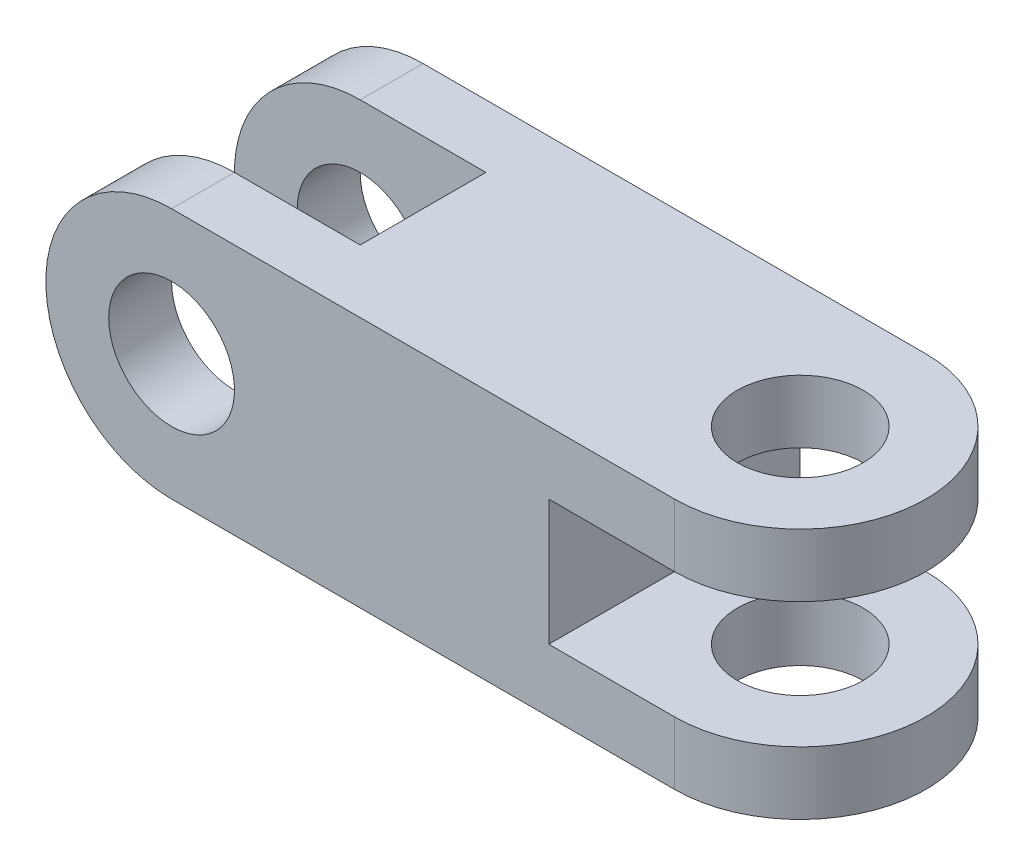
ISO-10303-21;
HEADER;
FILE_DESCRIPTION(('STEP AP214'),'2;1');
FILE_NAME('part.step','',(''),(''),'','','');
FILE_SCHEMA(('AUTOMOTIVE_DESIGN { 1 0 10303 214 1 1 1 1 }'));
ENDSEC;
DATA;
#1=APPLICATION_CONTEXT('core data for automotive mechanical design processes');
#2=APPLICATION_PROTOCOL_DEFINITION('international standard','automotive_design',2000,#1);
#3=PRODUCT_CONTEXT('',#1,'mechanical');
#4=PRODUCT('Part','Part','',(#3));
#5=PRODUCT_RELATED_PRODUCT_CATEGORY('part','',(#4));
#6=PRODUCT_DEFINITION_FORMATION('','',#4);
#7=PRODUCT_DEFINITION_CONTEXT('part definition',#1,'design');
#8=PRODUCT_DEFINITION('design','',#6,#7);
#9=PRODUCT_DEFINITION_SHAPE('','',#8);
#10=(LENGTH_UNIT() NAMED_UNIT(*) SI_UNIT(.MILLI.,.METRE.));
#11=(NAMED_UNIT(*) PLANE_ANGLE_UNIT() SI_UNIT($,.RADIAN.));
#12=(NAMED_UNIT(*) SI_UNIT($,.STERADIAN.) SOLID_ANGLE_UNIT());
#13=UNCERTAINTY_MEASURE_WITH_UNIT(LENGTH_MEASURE(1.E-05),#10,'distance_accuracy_value','');
#14=(GEOMETRIC_REPRESENTATION_CONTEXT(3) GLOBAL_UNCERTAINTY_ASSIGNED_CONTEXT((#13)) GLOBAL_UNIT_ASSIGNED_CONTEXT((#10,
#11,#12)) REPRESENTATION_CONTEXT('',''));
#15=CARTESIAN_POINT('',(0.,0.,0.));
#16=DIRECTION('',(0.,0.,1.));
#17=DIRECTION('',(1.,0.,0.));
#18=AXIS2_PLACEMENT_3D('',#15,#16,#17);
#19=CARTESIAN_POINT('',(50.,5.00000000000001,20.));
#20=DIRECTION('',(0.,-1.,0.));
#21=DIRECTION('',(1.,0.,0.));
#22=AXIS2_PLACEMENT_3D('',#19,#20,#21);
#23=PLANE('',#22);
#24=CARTESIAN_POINT('',(40.,5.00000000000001,10.));
#25=DIRECTION('',(0.,-1.,0.));
#26=DIRECTION('',(1.,0.,0.));
#27=AXIS2_PLACEMENT_3D('',#24,#25,#26);
#28=CIRCLE('',#27,5.00000000000001);
#29=CARTESIAN_POINT('',(45.,5.00000000000001,10.));
#30=VERTEX_POINT('',#29);
#31=EDGE_CURVE('E183',#30,#30,#28,.T.);
#32=ORIENTED_EDGE('',*,*,#31,.T.);
#33=EDGE_LOOP('',(#32));
#34=FACE_BOUND('',#33,.T.);
#35=CARTESIAN_POINT('',(40.,5.00000000000001,10.));
#36=DIRECTION('',(0.,-1.,0.));
#37=DIRECTION('',(1.,0.,0.));
#38=AXIS2_PLACEMENT_3D('',#35,#36,#37);
#39=CIRCLE('',#38,10.);
#40=CARTESIAN_POINT('',(40.,5.00000000000001,0.));
#41=VERTEX_POINT('',#40);
#42=CARTESIAN_POINT('',(40.,5.00000000000001,20.));
#43=VERTEX_POINT('',#42);
#44=EDGE_CURVE('E283',#41,#43,#39,.T.);
#45=ORIENTED_EDGE('',*,*,#44,.F.);
#46=DIRECTION('',(-1.,0.,0.));
#47=VECTOR('',#46,1.);
#48=CARTESIAN_POINT('',(50.,5.00000000000001,0.));
#49=LINE('',#48,#47);
#50=CARTESIAN_POINT('',(30.,5.00000000000001,0.));
#51=VERTEX_POINT('',#50);
#52=EDGE_CURVE('E282',#41,#51,#49,.T.);
#53=ORIENTED_EDGE('',*,*,#52,.T.);
#54=DIRECTION('',(0.,0.,-1.));
#55=VECTOR('',#54,1.);
#56=CARTESIAN_POINT('',(30.,5.00000000000001,20.));
#57=LINE('',#56,#55);
#58=CARTESIAN_POINT('',(30.,5.00000000000001,20.));
#59=VERTEX_POINT('',#58);
#60=EDGE_CURVE('E274',#59,#51,#57,.T.);
#61=ORIENTED_EDGE('',*,*,#60,.F.);
#62=DIRECTION('',(-1.,0.,0.));
#63=VECTOR('',#62,1.);
#64=CARTESIAN_POINT('',(50.,5.00000000000001,20.));
#65=LINE('',#64,#63);
#66=EDGE_CURVE('E287',#43,#59,#65,.T.);
#67=ORIENTED_EDGE('',*,*,#66,.F.);
#68=EDGE_LOOP('',(#45,#53,#61,#67));
#69=FACE_BOUND('',#68,.T.);
#70=ADVANCED_FACE('F38',(#34,#69),#23,.F.);
#71=CARTESIAN_POINT('',(50.,15.,20.));
#72=DIRECTION('',(0.,1.,0.));
#73=DIRECTION('',(-1.,0.,0.));
#74=AXIS2_PLACEMENT_3D('',#71,#72,#73);
#75=PLANE('',#74);
#76=CARTESIAN_POINT('',(40.,15.,10.));
#77=DIRECTION('',(0.,1.,0.));
#78=DIRECTION('',(-1.,0.,0.));
#79=AXIS2_PLACEMENT_3D('',#76,#77,#78);
#80=CIRCLE('',#79,5.00000000000001);
#81=CARTESIAN_POINT('',(35.,15.,10.));
#82=VERTEX_POINT('',#81);
#83=EDGE_CURVE('E180',#82,#82,#80,.T.);
#84=ORIENTED_EDGE('',*,*,#83,.T.);
#85=EDGE_LOOP('',(#84));
#86=FACE_BOUND('',#85,.T.);
#87=CARTESIAN_POINT('',(40.,15.,10.));
#88=DIRECTION('',(0.,1.,0.));
#89=DIRECTION('',(-1.,0.,0.));
#90=AXIS2_PLACEMENT_3D('',#87,#88,#89);
#91=CIRCLE('',#90,10.);
#92=CARTESIAN_POINT('',(40.,15.,20.));
#93=VERTEX_POINT('',#92);
#94=CARTESIAN_POINT('',(40.,15.,0.));
#95=VERTEX_POINT('',#94);
#96=EDGE_CURVE('E53',#93,#95,#91,.T.);
#97=ORIENTED_EDGE('',*,*,#96,.F.);
#98=DIRECTION('',(1.,0.,0.));
#99=VECTOR('',#98,1.);
#100=CARTESIAN_POINT('',(50.,15.,20.));
#101=LINE('',#100,#99);
#102=CARTESIAN_POINT('',(30.,15.,20.));
#103=VERTEX_POINT('',#102);
#104=EDGE_CURVE('E292',#103,#93,#101,.T.);
#105=ORIENTED_EDGE('',*,*,#104,.F.);
#106=DIRECTION('',(0.,0.,-1.));
#107=VECTOR('',#106,1.);
#108=CARTESIAN_POINT('',(30.,15.,20.));
#109=LINE('',#108,#107);
#110=CARTESIAN_POINT('',(30.,15.,0.));
#111=VERTEX_POINT('',#110);
#112=EDGE_CURVE('E302',#103,#111,#109,.T.);
#113=ORIENTED_EDGE('',*,*,#112,.T.);
#114=DIRECTION('',(1.,0.,0.));
#115=VECTOR('',#114,1.);
#116=CARTESIAN_POINT('',(50.,15.,0.));
#117=LINE('',#116,#115);
#118=EDGE_CURVE('E290',#111,#95,#117,.T.);
#119=ORIENTED_EDGE('',*,*,#118,.T.);
#120=EDGE_LOOP('',(#97,#105,#113,#119));
#121=FACE_BOUND('',#120,.T.);
#122=ADVANCED_FACE('F208',(#86,#121),#75,.F.);
#123=CARTESIAN_POINT('',(30.,15.,20.));
#124=DIRECTION('',(-1.,0.,0.));
#125=DIRECTION('',(0.,-1.,0.));
#126=AXIS2_PLACEMENT_3D('',#123,#124,#125);
#127=PLANE('',#126);
#128=DIRECTION('',(0.,1.,0.));
#129=VECTOR('',#128,1.);
#130=CARTESIAN_POINT('',(30.,15.,0.));
#131=LINE('',#130,#129);
#132=EDGE_CURVE('E294',#51,#111,#131,.T.);
#133=ORIENTED_EDGE('',*,*,#132,.T.);
#134=ORIENTED_EDGE('',*,*,#112,.F.);
#135=DIRECTION('',(0.,1.,0.));
#136=VECTOR('',#135,1.);
#137=CARTESIAN_POINT('',(30.,15.,20.));
#138=LINE('',#137,#136);
#139=EDGE_CURVE('E289',#59,#103,#138,.T.);
#140=ORIENTED_EDGE('',*,*,#139,.F.);
#141=ORIENTED_EDGE('',*,*,#60,.T.);
#142=EDGE_LOOP('',(#133,#134,#140,#141));
#143=FACE_BOUND('',#142,.T.);
#144=ADVANCED_FACE('F214',(#143),#127,.F.);
#145=CARTESIAN_POINT('',(40.,20.,10.));
#146=DIRECTION('',(0.,-1.,0.));
#147=DIRECTION('',(0.,0.,-1.));
#148=AXIS2_PLACEMENT_3D('',#145,#146,#147);
#149=PLANE('',#148);
#150=CARTESIAN_POINT('',(40.,20.,10.));
#151=DIRECTION('',(0.,1.,0.));
#152=DIRECTION('',(0.,0.,1.));
#153=AXIS2_PLACEMENT_3D('',#150,#151,#152);
#154=CIRCLE('',#153,5.00000000000001);
#155=CARTESIAN_POINT('',(40.,20.,15.));
#156=VERTEX_POINT('',#155);
#157=EDGE_CURVE('E237',#156,#156,#154,.T.);
#158=ORIENTED_EDGE('',*,*,#157,.F.);
#159=EDGE_LOOP('',(#158));
#160=FACE_BOUND('',#159,.T.);
#161=DIRECTION('',(-1.,0.,0.));
#162=VECTOR('',#161,1.);
#163=CARTESIAN_POINT('',(40.,20.,0.));
#164=LINE('',#163,#162);
#165=CARTESIAN_POINT('',(40.,20.,0.));
#166=VERTEX_POINT('',#165);
#167=CARTESIAN_POINT('',(0.,20.,0.));
#168=VERTEX_POINT('',#167);
#169=EDGE_CURVE('E161',#166,#168,#164,.T.);
#170=ORIENTED_EDGE('',*,*,#169,.T.);
#171=DIRECTION('',(0.,0.,-1.));
#172=VECTOR('',#171,1.);
#173=CARTESIAN_POINT('',(0.,20.,20.));
#174=LINE('',#173,#172);
#175=CARTESIAN_POINT('',(0.,20.,5.));
#176=VERTEX_POINT('',#175);
#177=EDGE_CURVE('E271',#176,#168,#174,.T.);
#178=ORIENTED_EDGE('',*,*,#177,.F.);
#179=DIRECTION('',(1.,0.,0.));
#180=VECTOR('',#179,1.);
#181=CARTESIAN_POINT('',(-10.,20.,5.));
#182=LINE('',#181,#180);
#183=CARTESIAN_POINT('',(10.,20.,5.));
#184=VERTEX_POINT('',#183);
#185=EDGE_CURVE('E245',#176,#184,#182,.T.);
#186=ORIENTED_EDGE('',*,*,#185,.T.);
#187=DIRECTION('',(0.,0.,1.));
#188=VECTOR('',#187,1.);
#189=CARTESIAN_POINT('',(10.,20.,15.));
#190=LINE('',#189,#188);
#191=CARTESIAN_POINT('',(10.,20.,15.));
#192=VERTEX_POINT('',#191);
#193=EDGE_CURVE('E247',#184,#192,#190,.T.);
#194=ORIENTED_EDGE('',*,*,#193,.T.);
#195=DIRECTION('',(-1.,0.,0.));
#196=VECTOR('',#195,1.);
#197=CARTESIAN_POINT('',(-10.,20.,15.));
#198=LINE('',#197,#196);
#199=CARTESIAN_POINT('',(0.,20.,15.));
#200=VERTEX_POINT('',#199);
#201=EDGE_CURVE('E249',#192,#200,#198,.T.);
#202=ORIENTED_EDGE('',*,*,#201,.T.);
#203=CARTESIAN_POINT('',(0.,20.,20.));
#204=VERTEX_POINT('',#203);
#205=EDGE_CURVE('E267',#204,#200,#174,.T.);
#206=ORIENTED_EDGE('',*,*,#205,.F.);
#207=DIRECTION('',(1.,0.,0.));
#208=VECTOR('',#207,1.);
#209=CARTESIAN_POINT('',(40.,20.,20.));
#210=LINE('',#209,#208);
#211=CARTESIAN_POINT('',(40.,20.,20.));
#212=VERTEX_POINT('',#211);
#213=EDGE_CURVE('E62',#204,#212,#210,.T.);
#214=ORIENTED_EDGE('',*,*,#213,.T.);
#215=CARTESIAN_POINT('',(40.,20.,10.));
#216=DIRECTION('',(0.,1.,0.));
#217=DIRECTION('',(0.,0.,-1.));
#218=AXIS2_PLACEMENT_3D('',#215,#216,#217);
#219=CIRCLE('',#218,10.);
#220=EDGE_CURVE('E89',#212,#166,#219,.T.);
#221=ORIENTED_EDGE('',*,*,#220,.T.);
#222=EDGE_LOOP('',(#170,#178,#186,#194,#202,#206,#214,#221));
#223=FACE_BOUND('',#222,.T.);
#224=ADVANCED_FACE('F225',(#160,#223),#149,.F.);
#225=CARTESIAN_POINT('',(40.,0.,10.));
#226=DIRECTION('',(0.,-1.,0.));
#227=DIRECTION('',(0.,0.,-1.));
#228=AXIS2_PLACEMENT_3D('',#225,#226,#227);
#229=PLANE('',#228);
#230=CARTESIAN_POINT('',(40.,0.,10.));
#231=DIRECTION('',(0.,1.,0.));
#232=DIRECTION('',(0.,0.,1.));
#233=AXIS2_PLACEMENT_3D('',#230,#231,#232);
#234=CIRCLE('',#233,5.00000000000001);
#235=CARTESIAN_POINT('',(40.,0.,15.));
#236=VERTEX_POINT('',#235);
#237=EDGE_CURVE('E236',#236,#236,#234,.T.);
#238=ORIENTED_EDGE('',*,*,#237,.T.);
#239=EDGE_LOOP('',(#238));
#240=FACE_BOUND('',#239,.T.);
#241=DIRECTION('',(0.,0.,-1.));
#242=VECTOR('',#241,1.);
#243=CARTESIAN_POINT('',(0.,0.,20.));
#244=LINE('',#243,#242);
#245=CARTESIAN_POINT('',(0.,0.,5.));
#246=VERTEX_POINT('',#245);
#247=CARTESIAN_POINT('',(0.,0.,0.));
#248=VERTEX_POINT('',#247);
#249=EDGE_CURVE('E147',#246,#248,#244,.T.);
#250=ORIENTED_EDGE('',*,*,#249,.T.);
#251=DIRECTION('',(-1.,0.,0.));
#252=VECTOR('',#251,1.);
#253=CARTESIAN_POINT('',(40.,0.,0.));
#254=LINE('',#253,#252);
#255=CARTESIAN_POINT('',(40.,0.,0.));
#256=VERTEX_POINT('',#255);
#257=EDGE_CURVE('E254',#256,#248,#254,.T.);
#258=ORIENTED_EDGE('',*,*,#257,.F.);
#259=CARTESIAN_POINT('',(40.,0.,10.));
#260=DIRECTION('',(0.,1.,0.));
#261=DIRECTION('',(0.,0.,-1.));
#262=AXIS2_PLACEMENT_3D('',#259,#260,#261);
#263=CIRCLE('',#262,10.);
#264=CARTESIAN_POINT('',(40.,0.,20.));
#265=VERTEX_POINT('',#264);
#266=EDGE_CURVE('E158',#265,#256,#263,.T.);
#267=ORIENTED_EDGE('',*,*,#266,.F.);
#268=DIRECTION('',(1.,0.,0.));
#269=VECTOR('',#268,1.);
#270=CARTESIAN_POINT('',(40.,0.,20.));
#271=LINE('',#270,#269);
#272=CARTESIAN_POINT('',(0.,0.,20.));
#273=VERTEX_POINT('',#272);
#274=EDGE_CURVE('E151',#273,#265,#271,.T.);
#275=ORIENTED_EDGE('',*,*,#274,.F.);
#276=CARTESIAN_POINT('',(0.,0.,15.));
#277=VERTEX_POINT('',#276);
#278=EDGE_CURVE('E137',#273,#277,#244,.T.);
#279=ORIENTED_EDGE('',*,*,#278,.T.);
#280=DIRECTION('',(-1.,0.,0.));
#281=VECTOR('',#280,1.);
#282=CARTESIAN_POINT('',(-10.,0.,15.));
#283=LINE('',#282,#281);
#284=CARTESIAN_POINT('',(10.,0.,15.));
#285=VERTEX_POINT('',#284);
#286=EDGE_CURVE('E159',#285,#277,#283,.T.);
#287=ORIENTED_EDGE('',*,*,#286,.F.);
#288=DIRECTION('',(0.,0.,1.));
#289=VECTOR('',#288,1.);
#290=CARTESIAN_POINT('',(10.,0.,15.));
#291=LINE('',#290,#289);
#292=CARTESIAN_POINT('',(10.,0.,5.));
#293=VERTEX_POINT('',#292);
#294=EDGE_CURVE('E163',#293,#285,#291,.T.);
#295=ORIENTED_EDGE('',*,*,#294,.F.);
#296=DIRECTION('',(1.,0.,0.));
#297=VECTOR('',#296,1.);
#298=CARTESIAN_POINT('',(-10.,0.,5.));
#299=LINE('',#298,#297);
#300=EDGE_CURVE('E257',#246,#293,#299,.T.);
#301=ORIENTED_EDGE('',*,*,#300,.F.);
#302=EDGE_LOOP('',(#250,#258,#267,#275,#279,#287,#295,#301));
#303=FACE_BOUND('',#302,.T.);
#304=ADVANCED_FACE('F156',(#240,#303),#229,.T.);
#305=CARTESIAN_POINT('',(40.,20.,10.));
#306=DIRECTION('',(0.,-1.,0.));
#307=DIRECTION('',(0.,0.,-1.));
#308=AXIS2_PLACEMENT_3D('',#305,#306,#307);
#309=CYLINDRICAL_SURFACE('',#308,10.);
#310=ORIENTED_EDGE('',*,*,#266,.T.);
#311=DIRECTION('',(0.,-1.,0.));
#312=VECTOR('',#311,1.);
#313=CARTESIAN_POINT('',(40.,20.,0.));
#314=LINE('',#313,#312);
#315=EDGE_CURVE('E176',#41,#256,#314,.T.);
#316=ORIENTED_EDGE('',*,*,#315,.F.);
#317=ORIENTED_EDGE('',*,*,#44,.T.);
#318=DIRECTION('',(0.,-1.,0.));
#319=VECTOR('',#318,1.);
#320=CARTESIAN_POINT('',(40.,20.,20.));
#321=LINE('',#320,#319);
#322=EDGE_CURVE('E84',#43,#265,#321,.T.);
#323=ORIENTED_EDGE('',*,*,#322,.T.);
#324=EDGE_LOOP('',(#310,#316,#317,#323));
#325=FACE_BOUND('',#324,.T.);
#326=ADVANCED_FACE('F40',(#325),#309,.T.);
#327=EDGE_CURVE('E177',#166,#95,#314,.T.);
#328=ORIENTED_EDGE('',*,*,#327,.F.);
#329=ORIENTED_EDGE('',*,*,#220,.F.);
#330=EDGE_CURVE('E167',#212,#93,#321,.T.);
#331=ORIENTED_EDGE('',*,*,#330,.T.);
#332=ORIENTED_EDGE('',*,*,#96,.T.);
#333=EDGE_LOOP('',(#328,#329,#331,#332));
#334=FACE_BOUND('',#333,.T.);
#335=ADVANCED_FACE('F233',(#334),#309,.T.);
#336=CARTESIAN_POINT('',(40.,20.,0.));
#337=DIRECTION('',(0.,0.,1.));
#338=DIRECTION('',(1.,0.,0.));
#339=AXIS2_PLACEMENT_3D('',#336,#337,#338);
#340=PLANE('',#339);
#341=CARTESIAN_POINT('',(0.,10.,0.));
#342=DIRECTION('',(0.,0.,1.));
#343=DIRECTION('',(1.,0.,0.));
#344=AXIS2_PLACEMENT_3D('',#341,#342,#343);
#345=CIRCLE('',#344,5.);
#346=CARTESIAN_POINT('',(5.,10.,0.));
#347=VERTEX_POINT('',#346);
#348=EDGE_CURVE('E11',#347,#347,#345,.F.);
#349=ORIENTED_EDGE('',*,*,#348,.F.);
#350=EDGE_LOOP('',(#349));
#351=FACE_BOUND('',#350,.T.);
#352=ORIENTED_EDGE('',*,*,#257,.T.);
#353=CARTESIAN_POINT('',(0.,10.,0.));
#354=DIRECTION('',(0.,0.,1.));
#355=DIRECTION('',(-1.,0.,0.));
#356=AXIS2_PLACEMENT_3D('',#353,#354,#355);
#357=CIRCLE('',#356,10.);
#358=EDGE_CURVE('E278',#168,#248,#357,.T.);
#359=ORIENTED_EDGE('',*,*,#358,.F.);
#360=ORIENTED_EDGE('',*,*,#169,.F.);
#361=ORIENTED_EDGE('',*,*,#327,.T.);
#362=ORIENTED_EDGE('',*,*,#118,.F.);
#363=ORIENTED_EDGE('',*,*,#132,.F.);
#364=ORIENTED_EDGE('',*,*,#52,.F.);
#365=ORIENTED_EDGE('',*,*,#315,.T.);
#366=EDGE_LOOP('',(#352,#359,#360,#361,#362,#363,#364,#365));
#367=FACE_BOUND('',#366,.T.);
#368=ADVANCED_FACE('F277',(#351,#367),#340,.F.);
#369=CARTESIAN_POINT('',(-10.,20.,5.));
#370=DIRECTION('',(0.,0.,-1.));
#371=DIRECTION('',(-1.,0.,0.));
#372=AXIS2_PLACEMENT_3D('',#369,#370,#371);
#373=PLANE('',#372);
#374=CARTESIAN_POINT('',(0.,10.,5.));
#375=DIRECTION('',(0.,0.,-1.));
#376=DIRECTION('',(-1.,0.,0.));
#377=AXIS2_PLACEMENT_3D('',#374,#375,#376);
#378=CIRCLE('',#377,5.);
#379=CARTESIAN_POINT('',(-5.,10.,5.));
#380=VERTEX_POINT('',#379);
#381=EDGE_CURVE('E46',#380,#380,#378,.F.);
#382=ORIENTED_EDGE('',*,*,#381,.F.);
#383=EDGE_LOOP('',(#382));
#384=FACE_BOUND('',#383,.T.);
#385=CARTESIAN_POINT('',(0.,10.,5.));
#386=DIRECTION('',(0.,0.,-1.));
#387=DIRECTION('',(-1.,0.,0.));
#388=AXIS2_PLACEMENT_3D('',#385,#386,#387);
#389=CIRCLE('',#388,10.);
#390=EDGE_CURVE('E238',#176,#246,#389,.F.);
#391=ORIENTED_EDGE('',*,*,#390,.T.);
#392=ORIENTED_EDGE('',*,*,#300,.T.);
#393=DIRECTION('',(0.,-1.,0.));
#394=VECTOR('',#393,1.);
#395=CARTESIAN_POINT('',(10.,20.,5.));
#396=LINE('',#395,#394);
#397=EDGE_CURVE('E173',#184,#293,#396,.T.);
#398=ORIENTED_EDGE('',*,*,#397,.F.);
#399=ORIENTED_EDGE('',*,*,#185,.F.);
#400=EDGE_LOOP('',(#391,#392,#398,#399));
#401=FACE_BOUND('',#400,.T.);
#402=ADVANCED_FACE('F203',(#384,#401),#373,.F.);
#403=CARTESIAN_POINT('',(-10.,20.,15.));
#404=DIRECTION('',(0.,0.,1.));
#405=DIRECTION('',(1.,0.,0.));
#406=AXIS2_PLACEMENT_3D('',#403,#404,#405);
#407=PLANE('',#406);
#408=CARTESIAN_POINT('',(0.,10.,15.));
#409=DIRECTION('',(0.,0.,1.));
#410=DIRECTION('',(1.,0.,0.));
#411=AXIS2_PLACEMENT_3D('',#408,#409,#410);
#412=CIRCLE('',#411,5.);
#413=CARTESIAN_POINT('',(5.,10.,15.));
#414=VERTEX_POINT('',#413);
#415=EDGE_CURVE('E153',#414,#414,#412,.F.);
#416=ORIENTED_EDGE('',*,*,#415,.F.);
#417=EDGE_LOOP('',(#416));
#418=FACE_BOUND('',#417,.T.);
#419=ORIENTED_EDGE('',*,*,#286,.T.);
#420=CARTESIAN_POINT('',(0.,10.,15.));
#421=DIRECTION('',(0.,0.,1.));
#422=DIRECTION('',(1.,0.,0.));
#423=AXIS2_PLACEMENT_3D('',#420,#421,#422);
#424=CIRCLE('',#423,10.);
#425=EDGE_CURVE('E142',#277,#200,#424,.F.);
#426=ORIENTED_EDGE('',*,*,#425,.T.);
#427=ORIENTED_EDGE('',*,*,#201,.F.);
#428=DIRECTION('',(0.,-1.,0.));
#429=VECTOR('',#428,1.);
#430=CARTESIAN_POINT('',(10.,20.,15.));
#431=LINE('',#430,#429);
#432=EDGE_CURVE('E170',#192,#285,#431,.T.);
#433=ORIENTED_EDGE('',*,*,#432,.T.);
#434=EDGE_LOOP('',(#419,#426,#427,#433));
#435=FACE_BOUND('',#434,.T.);
#436=ADVANCED_FACE('F194',(#418,#435),#407,.F.);
#437=CARTESIAN_POINT('',(40.,20.,20.));
#438=DIRECTION('',(0.,0.,-1.));
#439=DIRECTION('',(-1.,0.,0.));
#440=AXIS2_PLACEMENT_3D('',#437,#438,#439);
#441=PLANE('',#440);
#442=CARTESIAN_POINT('',(0.,10.,20.));
#443=DIRECTION('',(0.,0.,-1.));
#444=DIRECTION('',(-1.,0.,0.));
#445=AXIS2_PLACEMENT_3D('',#442,#443,#444);
#446=CIRCLE('',#445,5.);
#447=CARTESIAN_POINT('',(-5.,10.,20.));
#448=VERTEX_POINT('',#447);
#449=EDGE_CURVE('E154',#448,#448,#446,.F.);
#450=ORIENTED_EDGE('',*,*,#449,.F.);
#451=EDGE_LOOP('',(#450));
#452=FACE_BOUND('',#451,.T.);
#453=ORIENTED_EDGE('',*,*,#213,.F.);
#454=CARTESIAN_POINT('',(0.,10.,20.));
#455=DIRECTION('',(0.,0.,-1.));
#456=DIRECTION('',(-1.,0.,0.));
#457=AXIS2_PLACEMENT_3D('',#454,#455,#456);
#458=CIRCLE('',#457,10.);
#459=EDGE_CURVE('E141',#204,#273,#458,.F.);
#460=ORIENTED_EDGE('',*,*,#459,.T.);
#461=ORIENTED_EDGE('',*,*,#274,.T.);
#462=ORIENTED_EDGE('',*,*,#322,.F.);
#463=ORIENTED_EDGE('',*,*,#66,.T.);
#464=ORIENTED_EDGE('',*,*,#139,.T.);
#465=ORIENTED_EDGE('',*,*,#104,.T.);
#466=ORIENTED_EDGE('',*,*,#330,.F.);
#467=EDGE_LOOP('',(#453,#460,#461,#462,#463,#464,#465,#466));
#468=FACE_BOUND('',#467,.T.);
#469=ADVANCED_FACE('F150',(#452,#468),#441,.F.);
#470=CARTESIAN_POINT('',(40.,20.,10.));
#471=DIRECTION('',(0.,-1.,0.));
#472=DIRECTION('',(0.,0.,-1.));
#473=AXIS2_PLACEMENT_3D('',#470,#471,#472);
#474=CYLINDRICAL_SURFACE('',#473,5.00000000000001);
#475=ORIENTED_EDGE('',*,*,#237,.F.);
#476=EDGE_LOOP('',(#475));
#477=FACE_BOUND('',#476,.T.);
#478=ORIENTED_EDGE('',*,*,#31,.F.);
#479=EDGE_LOOP('',(#478));
#480=FACE_BOUND('',#479,.T.);
#481=ADVANCED_FACE('F193',(#477,#480),#474,.F.);
#482=ORIENTED_EDGE('',*,*,#157,.T.);
#483=EDGE_LOOP('',(#482));
#484=FACE_BOUND('',#483,.T.);
#485=ORIENTED_EDGE('',*,*,#83,.F.);
#486=EDGE_LOOP('',(#485));
#487=FACE_BOUND('',#486,.T.);
#488=ADVANCED_FACE('F200',(#484,#487),#474,.F.);
#489=CARTESIAN_POINT('',(10.,20.,15.));
#490=DIRECTION('',(1.,0.,0.));
#491=DIRECTION('',(0.,0.,-1.));
#492=AXIS2_PLACEMENT_3D('',#489,#490,#491);
#493=PLANE('',#492);
#494=ORIENTED_EDGE('',*,*,#294,.T.);
#495=ORIENTED_EDGE('',*,*,#432,.F.);
#496=ORIENTED_EDGE('',*,*,#193,.F.);
#497=ORIENTED_EDGE('',*,*,#397,.T.);
#498=EDGE_LOOP('',(#494,#495,#496,#497));
#499=FACE_BOUND('',#498,.T.);
#500=ADVANCED_FACE('F261',(#499),#493,.F.);
#501=CARTESIAN_POINT('',(0.,10.,20.));
#502=DIRECTION('',(0.,0.,-1.));
#503=DIRECTION('',(-1.,0.,0.));
#504=AXIS2_PLACEMENT_3D('',#501,#502,#503);
#505=CYLINDRICAL_SURFACE('',#504,5.);
#506=ORIENTED_EDGE('',*,*,#449,.T.);
#507=EDGE_LOOP('',(#506));
#508=FACE_BOUND('',#507,.T.);
#509=ORIENTED_EDGE('',*,*,#415,.T.);
#510=EDGE_LOOP('',(#509));
#511=FACE_BOUND('',#510,.T.);
#512=ADVANCED_FACE('F189',(#508,#511),#505,.F.);
#513=CARTESIAN_POINT('',(0.,10.,20.));
#514=DIRECTION('',(0.,0.,-1.));
#515=DIRECTION('',(-1.,0.,0.));
#516=AXIS2_PLACEMENT_3D('',#513,#514,#515);
#517=CYLINDRICAL_SURFACE('',#516,10.);
#518=ORIENTED_EDGE('',*,*,#425,.F.);
#519=ORIENTED_EDGE('',*,*,#278,.F.);
#520=ORIENTED_EDGE('',*,*,#459,.F.);
#521=ORIENTED_EDGE('',*,*,#205,.T.);
#522=EDGE_LOOP('',(#518,#519,#520,#521));
#523=FACE_BOUND('',#522,.T.);
#524=ADVANCED_FACE('F139',(#523),#517,.T.);
#525=ORIENTED_EDGE('',*,*,#348,.T.);
#526=EDGE_LOOP('',(#525));
#527=FACE_BOUND('',#526,.T.);
#528=ORIENTED_EDGE('',*,*,#381,.T.);
#529=EDGE_LOOP('',(#528));
#530=FACE_BOUND('',#529,.T.);
#531=ADVANCED_FACE('F222',(#527,#530),#505,.F.);
#532=ORIENTED_EDGE('',*,*,#249,.F.);
#533=ORIENTED_EDGE('',*,*,#390,.F.);
#534=ORIENTED_EDGE('',*,*,#177,.T.);
#535=ORIENTED_EDGE('',*,*,#358,.T.);
#536=EDGE_LOOP('',(#532,#533,#534,#535));
#537=FACE_BOUND('',#536,.T.);
#538=ADVANCED_FACE('F220',(#537),#517,.T.);
#539=CLOSED_SHELL('',(#70,#122,#144,#224,#304,#326,#335,#368,#402,#436,#469,#481,#488,#500,#512,
#524,#531,#538));
#540=MANIFOLD_SOLID_BREP('B2',#539);
#541=ADVANCED_BREP_SHAPE_REPRESENTATION('',(#18,#540),#14);
#542=SHAPE_DEFINITION_REPRESENTATION(#9,#541);
ENDSEC;
END-ISO-10303-21;
